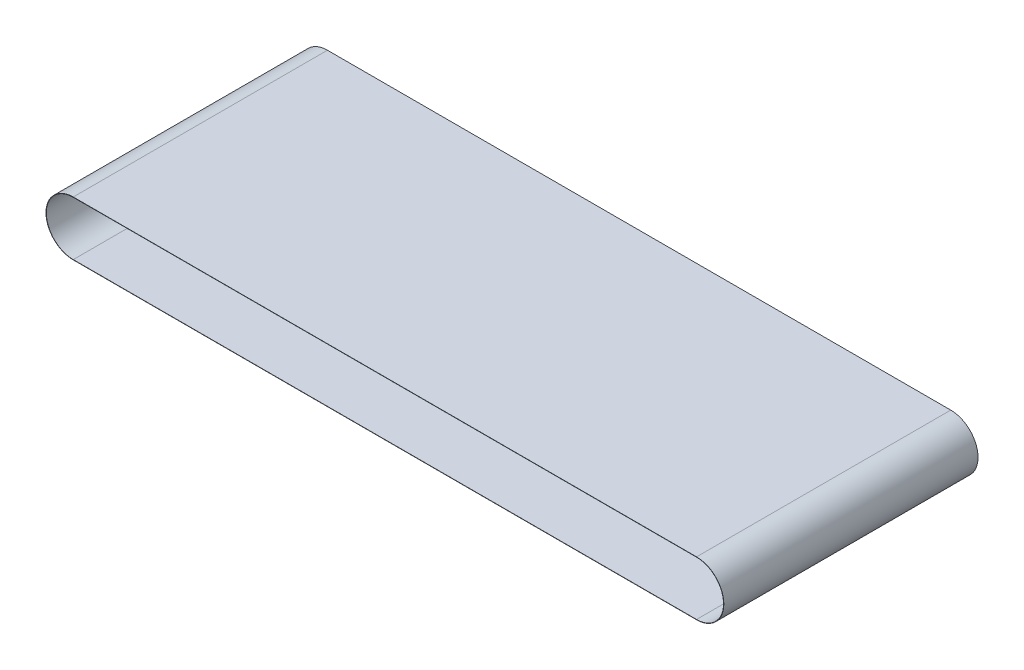
ISO-10303-21;
HEADER;
FILE_DESCRIPTION(('STEP AP214'),'2;1');
FILE_NAME('part.step','',(''),(''),'','','');
FILE_SCHEMA(('AUTOMOTIVE_DESIGN { 1 0 10303 214 1 1 1 1 }'));
ENDSEC;
DATA;
#1=APPLICATION_CONTEXT('core data for automotive mechanical design processes');
#2=APPLICATION_PROTOCOL_DEFINITION('international standard','automotive_design',2000,#1);
#3=PRODUCT_CONTEXT('',#1,'mechanical');
#4=PRODUCT('Part','Part','',(#3));
#5=PRODUCT_RELATED_PRODUCT_CATEGORY('part','',(#4));
#6=PRODUCT_DEFINITION_FORMATION('','',#4);
#7=PRODUCT_DEFINITION_CONTEXT('part definition',#1,'design');
#8=PRODUCT_DEFINITION('design','',#6,#7);
#9=PRODUCT_DEFINITION_SHAPE('','',#8);
#10=(LENGTH_UNIT() NAMED_UNIT(*) SI_UNIT(.MILLI.,.METRE.));
#11=(NAMED_UNIT(*) PLANE_ANGLE_UNIT() SI_UNIT($,.RADIAN.));
#12=(NAMED_UNIT(*) SI_UNIT($,.STERADIAN.) SOLID_ANGLE_UNIT());
#13=UNCERTAINTY_MEASURE_WITH_UNIT(LENGTH_MEASURE(1.E-05),#10,'distance_accuracy_value','');
#14=(GEOMETRIC_REPRESENTATION_CONTEXT(3) GLOBAL_UNCERTAINTY_ASSIGNED_CONTEXT((#13)) GLOBAL_UNIT_ASSIGNED_CONTEXT((#10,
#11,#12)) REPRESENTATION_CONTEXT('',''));
#15=CARTESIAN_POINT('',(0.,0.,0.));
#16=DIRECTION('',(0.,0.,1.));
#17=DIRECTION('',(1.,0.,0.));
#18=AXIS2_PLACEMENT_3D('',#15,#16,#17);
#19=CARTESIAN_POINT('',(0.,0.,-114.3));
#20=DIRECTION('',(0.,0.,1.));
#21=DIRECTION('',(1.,0.,0.));
#22=AXIS2_PLACEMENT_3D('',#19,#20,#21);
#23=CYLINDRICAL_SURFACE('',#22,24.511);
#24=CARTESIAN_POINT('',(0.,0.,114.3));
#25=DIRECTION('',(0.,0.,1.));
#26=DIRECTION('',(1.,0.,0.));
#27=AXIS2_PLACEMENT_3D('',#24,#25,#26);
#28=CIRCLE('',#27,24.511);
#29=CARTESIAN_POINT('',(0.,24.511,114.3));
#30=VERTEX_POINT('',#29);
#31=CARTESIAN_POINT('',(0.,-24.511,114.3));
#32=VERTEX_POINT('',#31);
#33=EDGE_CURVE('E148',#30,#32,#28,.T.);
#34=ORIENTED_EDGE('',*,*,#33,.F.);
#35=DIRECTION('',(0.,0.,1.));
#36=VECTOR('',#35,1.);
#37=CARTESIAN_POINT('',(0.,24.511,-114.3));
#38=LINE('',#37,#36);
#39=CARTESIAN_POINT('',(0.,24.511,-114.3));
#40=VERTEX_POINT('',#39);
#41=EDGE_CURVE('E11',#40,#30,#38,.T.);
#42=ORIENTED_EDGE('',*,*,#41,.F.);
#43=CARTESIAN_POINT('',(0.,0.,-114.3));
#44=DIRECTION('',(0.,0.,1.));
#45=DIRECTION('',(1.,0.,0.));
#46=AXIS2_PLACEMENT_3D('',#43,#44,#45);
#47=CIRCLE('',#46,24.511);
#48=CARTESIAN_POINT('',(0.,-24.511,-114.3));
#49=VERTEX_POINT('',#48);
#50=EDGE_CURVE('E154',#40,#49,#47,.T.);
#51=ORIENTED_EDGE('',*,*,#50,.T.);
#52=DIRECTION('',(0.,0.,1.));
#53=VECTOR('',#52,1.);
#54=CARTESIAN_POINT('',(0.,-24.511,-114.3));
#55=LINE('',#54,#53);
#56=EDGE_CURVE('E42',#49,#32,#55,.T.);
#57=ORIENTED_EDGE('',*,*,#56,.T.);
#58=EDGE_LOOP('',(#34,#42,#51,#57));
#59=FACE_BOUND('',#58,.T.);
#60=ADVANCED_FACE('F39',(#59),#23,.T.);
#61=CARTESIAN_POINT('',(0.,24.511,-114.3));
#62=DIRECTION('',(0.,1.,0.));
#63=DIRECTION('',(0.,0.,1.));
#64=AXIS2_PLACEMENT_3D('',#61,#62,#63);
#65=PLANE('',#64);
#66=DIRECTION('',(-1.,0.,0.));
#67=VECTOR('',#66,1.);
#68=CARTESIAN_POINT('',(0.,24.511,114.3));
#69=LINE('',#68,#67);
#70=CARTESIAN_POINT('',(560.578,24.511,114.3));
#71=VERTEX_POINT('',#70);
#72=EDGE_CURVE('E159',#71,#30,#69,.T.);
#73=ORIENTED_EDGE('',*,*,#72,.F.);
#74=DIRECTION('',(0.,0.,1.));
#75=VECTOR('',#74,1.);
#76=CARTESIAN_POINT('',(560.578,24.511,-114.3));
#77=LINE('',#76,#75);
#78=CARTESIAN_POINT('',(560.578,24.511,-114.3));
#79=VERTEX_POINT('',#78);
#80=EDGE_CURVE('E48',#79,#71,#77,.T.);
#81=ORIENTED_EDGE('',*,*,#80,.F.);
#82=DIRECTION('',(-1.,0.,0.));
#83=VECTOR('',#82,1.);
#84=CARTESIAN_POINT('',(0.,24.511,-114.3));
#85=LINE('',#84,#83);
#86=EDGE_CURVE('E167',#79,#40,#85,.T.);
#87=ORIENTED_EDGE('',*,*,#86,.T.);
#88=ORIENTED_EDGE('',*,*,#41,.T.);
#89=EDGE_LOOP('',(#73,#81,#87,#88));
#90=FACE_BOUND('',#89,.T.);
#91=ADVANCED_FACE('F201',(#90),#65,.T.);
#92=CARTESIAN_POINT('',(560.578,0.,-114.3));
#93=DIRECTION('',(0.,0.,1.));
#94=DIRECTION('',(1.,0.,0.));
#95=AXIS2_PLACEMENT_3D('',#92,#93,#94);
#96=CYLINDRICAL_SURFACE('',#95,24.511);
#97=CARTESIAN_POINT('',(560.578,0.,114.3));
#98=DIRECTION('',(0.,0.,1.));
#99=DIRECTION('',(1.,0.,0.));
#100=AXIS2_PLACEMENT_3D('',#97,#98,#99);
#101=CIRCLE('',#100,24.511);
#102=CARTESIAN_POINT('',(560.578,-24.511,114.3));
#103=VERTEX_POINT('',#102);
#104=EDGE_CURVE('E178',#103,#71,#101,.T.);
#105=ORIENTED_EDGE('',*,*,#104,.F.);
#106=DIRECTION('',(0.,0.,1.));
#107=VECTOR('',#106,1.);
#108=CARTESIAN_POINT('',(560.578,-24.511,-114.3));
#109=LINE('',#108,#107);
#110=CARTESIAN_POINT('',(560.578,-24.511,-114.3));
#111=VERTEX_POINT('',#110);
#112=EDGE_CURVE('E186',#111,#103,#109,.T.);
#113=ORIENTED_EDGE('',*,*,#112,.F.);
#114=CARTESIAN_POINT('',(560.578,0.,-114.3));
#115=DIRECTION('',(0.,0.,1.));
#116=DIRECTION('',(1.,0.,0.));
#117=AXIS2_PLACEMENT_3D('',#114,#115,#116);
#118=CIRCLE('',#117,24.511);
#119=EDGE_CURVE('E163',#111,#79,#118,.T.);
#120=ORIENTED_EDGE('',*,*,#119,.T.);
#121=ORIENTED_EDGE('',*,*,#80,.T.);
#122=EDGE_LOOP('',(#105,#113,#120,#121));
#123=FACE_BOUND('',#122,.T.);
#124=ADVANCED_FACE('F205',(#123),#96,.T.);
#125=CARTESIAN_POINT('',(0.,-24.511,-114.3));
#126=DIRECTION('',(0.,-1.,0.));
#127=DIRECTION('',(0.,0.,-1.));
#128=AXIS2_PLACEMENT_3D('',#125,#126,#127);
#129=PLANE('',#128);
#130=DIRECTION('',(1.,0.,0.));
#131=VECTOR('',#130,1.);
#132=CARTESIAN_POINT('',(0.,-24.511,114.3));
#133=LINE('',#132,#131);
#134=EDGE_CURVE('E174',#32,#103,#133,.T.);
#135=ORIENTED_EDGE('',*,*,#134,.F.);
#136=ORIENTED_EDGE('',*,*,#56,.F.);
#137=DIRECTION('',(1.,0.,0.));
#138=VECTOR('',#137,1.);
#139=CARTESIAN_POINT('',(0.,-24.511,-114.3));
#140=LINE('',#139,#138);
#141=EDGE_CURVE('E158',#49,#111,#140,.T.);
#142=ORIENTED_EDGE('',*,*,#141,.T.);
#143=ORIENTED_EDGE('',*,*,#112,.T.);
#144=EDGE_LOOP('',(#135,#136,#142,#143));
#145=FACE_BOUND('',#144,.T.);
#146=ADVANCED_FACE('F196',(#145),#129,.T.);
#147=CARTESIAN_POINT('',(0.,0.,-114.3));
#148=DIRECTION('',(0.,0.,1.));
#149=DIRECTION('',(1.,0.,0.));
#150=AXIS2_PLACEMENT_3D('',#147,#148,#149);
#151=PLANE('',#150);
#152=DIRECTION('',(-1.,0.,0.));
#153=VECTOR('',#152,1.);
#154=CARTESIAN_POINT('',(0.,24.257,-114.3));
#155=LINE('',#154,#153);
#156=CARTESIAN_POINT('',(560.578,24.257,-114.3));
#157=VERTEX_POINT('',#156);
#158=CARTESIAN_POINT('',(0.,24.257,-114.3));
#159=VERTEX_POINT('',#158);
#160=EDGE_CURVE('E114',#157,#159,#155,.T.);
#161=ORIENTED_EDGE('',*,*,#160,.T.);
#162=CARTESIAN_POINT('',(0.,0.,-114.3));
#163=DIRECTION('',(0.,0.,1.));
#164=DIRECTION('',(1.,0.,0.));
#165=AXIS2_PLACEMENT_3D('',#162,#163,#164);
#166=CIRCLE('',#165,24.257);
#167=CARTESIAN_POINT('',(0.,-24.257,-114.3));
#168=VERTEX_POINT('',#167);
#169=EDGE_CURVE('E107',#159,#168,#166,.T.);
#170=ORIENTED_EDGE('',*,*,#169,.T.);
#171=DIRECTION('',(1.,0.,0.));
#172=VECTOR('',#171,1.);
#173=CARTESIAN_POINT('',(0.,-24.257,-114.3));
#174=LINE('',#173,#172);
#175=CARTESIAN_POINT('',(560.578,-24.257,-114.3));
#176=VERTEX_POINT('',#175);
#177=EDGE_CURVE('E117',#168,#176,#174,.T.);
#178=ORIENTED_EDGE('',*,*,#177,.T.);
#179=CARTESIAN_POINT('',(560.578,0.,-114.3));
#180=DIRECTION('',(0.,0.,1.));
#181=DIRECTION('',(1.,0.,0.));
#182=AXIS2_PLACEMENT_3D('',#179,#180,#181);
#183=CIRCLE('',#182,24.257);
#184=EDGE_CURVE('E56',#176,#157,#183,.T.);
#185=ORIENTED_EDGE('',*,*,#184,.T.);
#186=EDGE_LOOP('',(#161,#170,#178,#185));
#187=FACE_BOUND('',#186,.T.);
#188=ORIENTED_EDGE('',*,*,#50,.F.);
#189=ORIENTED_EDGE('',*,*,#86,.F.);
#190=ORIENTED_EDGE('',*,*,#119,.F.);
#191=ORIENTED_EDGE('',*,*,#141,.F.);
#192=EDGE_LOOP('',(#188,#189,#190,#191));
#193=FACE_BOUND('',#192,.T.);
#194=ADVANCED_FACE('F122',(#187,#193),#151,.F.);
#195=CARTESIAN_POINT('',(0.,0.,114.3));
#196=DIRECTION('',(0.,0.,1.));
#197=DIRECTION('',(1.,0.,0.));
#198=AXIS2_PLACEMENT_3D('',#195,#196,#197);
#199=PLANE('',#198);
#200=CARTESIAN_POINT('',(0.,0.,114.3));
#201=DIRECTION('',(0.,0.,1.));
#202=DIRECTION('',(1.,0.,0.));
#203=AXIS2_PLACEMENT_3D('',#200,#201,#202);
#204=CIRCLE('',#203,24.257);
#205=CARTESIAN_POINT('',(0.,24.257,114.3));
#206=VERTEX_POINT('',#205);
#207=CARTESIAN_POINT('',(0.,-24.257,114.3));
#208=VERTEX_POINT('',#207);
#209=EDGE_CURVE('E64',#206,#208,#204,.T.);
#210=ORIENTED_EDGE('',*,*,#209,.F.);
#211=DIRECTION('',(-1.,0.,0.));
#212=VECTOR('',#211,1.);
#213=CARTESIAN_POINT('',(0.,24.257,114.3));
#214=LINE('',#213,#212);
#215=CARTESIAN_POINT('',(560.578,24.257,114.3));
#216=VERTEX_POINT('',#215);
#217=EDGE_CURVE('E126',#216,#206,#214,.T.);
#218=ORIENTED_EDGE('',*,*,#217,.F.);
#219=CARTESIAN_POINT('',(560.578,0.,114.3));
#220=DIRECTION('',(0.,0.,1.));
#221=DIRECTION('',(1.,0.,0.));
#222=AXIS2_PLACEMENT_3D('',#219,#220,#221);
#223=CIRCLE('',#222,24.257);
#224=CARTESIAN_POINT('',(560.578,-24.257,114.3));
#225=VERTEX_POINT('',#224);
#226=EDGE_CURVE('E130',#225,#216,#223,.T.);
#227=ORIENTED_EDGE('',*,*,#226,.F.);
#228=DIRECTION('',(1.,0.,0.));
#229=VECTOR('',#228,1.);
#230=CARTESIAN_POINT('',(0.,-24.257,114.3));
#231=LINE('',#230,#229);
#232=EDGE_CURVE('E139',#208,#225,#231,.T.);
#233=ORIENTED_EDGE('',*,*,#232,.F.);
#234=EDGE_LOOP('',(#210,#218,#227,#233));
#235=FACE_BOUND('',#234,.T.);
#236=ORIENTED_EDGE('',*,*,#33,.T.);
#237=ORIENTED_EDGE('',*,*,#134,.T.);
#238=ORIENTED_EDGE('',*,*,#104,.T.);
#239=ORIENTED_EDGE('',*,*,#72,.T.);
#240=EDGE_LOOP('',(#236,#237,#238,#239));
#241=FACE_BOUND('',#240,.T.);
#242=ADVANCED_FACE('F198',(#235,#241),#199,.T.);
#243=CARTESIAN_POINT('',(0.,0.,-114.3));
#244=DIRECTION('',(0.,0.,1.));
#245=DIRECTION('',(1.,0.,0.));
#246=AXIS2_PLACEMENT_3D('',#243,#244,#245);
#247=CYLINDRICAL_SURFACE('',#246,24.257);
#248=ORIENTED_EDGE('',*,*,#209,.T.);
#249=DIRECTION('',(0.,0.,1.));
#250=VECTOR('',#249,1.);
#251=CARTESIAN_POINT('',(0.,-24.257,-114.3));
#252=LINE('',#251,#250);
#253=EDGE_CURVE('E103',#168,#208,#252,.T.);
#254=ORIENTED_EDGE('',*,*,#253,.F.);
#255=ORIENTED_EDGE('',*,*,#169,.F.);
#256=DIRECTION('',(0.,0.,1.));
#257=VECTOR('',#256,1.);
#258=CARTESIAN_POINT('',(0.,24.257,-114.3));
#259=LINE('',#258,#257);
#260=EDGE_CURVE('E145',#159,#206,#259,.T.);
#261=ORIENTED_EDGE('',*,*,#260,.T.);
#262=EDGE_LOOP('',(#248,#254,#255,#261));
#263=FACE_BOUND('',#262,.T.);
#264=ADVANCED_FACE('F105',(#263),#247,.F.);
#265=CARTESIAN_POINT('',(0.,24.257,-114.3));
#266=DIRECTION('',(0.,1.,0.));
#267=DIRECTION('',(0.,0.,1.));
#268=AXIS2_PLACEMENT_3D('',#265,#266,#267);
#269=PLANE('',#268);
#270=ORIENTED_EDGE('',*,*,#217,.T.);
#271=ORIENTED_EDGE('',*,*,#260,.F.);
#272=ORIENTED_EDGE('',*,*,#160,.F.);
#273=DIRECTION('',(0.,0.,1.));
#274=VECTOR('',#273,1.);
#275=CARTESIAN_POINT('',(560.578,24.257,-114.3));
#276=LINE('',#275,#274);
#277=EDGE_CURVE('E149',#157,#216,#276,.T.);
#278=ORIENTED_EDGE('',*,*,#277,.T.);
#279=EDGE_LOOP('',(#270,#271,#272,#278));
#280=FACE_BOUND('',#279,.T.);
#281=ADVANCED_FACE('F256',(#280),#269,.F.);
#282=CARTESIAN_POINT('',(560.578,0.,-114.3));
#283=DIRECTION('',(0.,0.,1.));
#284=DIRECTION('',(1.,0.,0.));
#285=AXIS2_PLACEMENT_3D('',#282,#283,#284);
#286=CYLINDRICAL_SURFACE('',#285,24.257);
#287=ORIENTED_EDGE('',*,*,#226,.T.);
#288=ORIENTED_EDGE('',*,*,#277,.F.);
#289=ORIENTED_EDGE('',*,*,#184,.F.);
#290=DIRECTION('',(0.,0.,1.));
#291=VECTOR('',#290,1.);
#292=CARTESIAN_POINT('',(560.578,-24.257,-114.3));
#293=LINE('',#292,#291);
#294=EDGE_CURVE('E113',#176,#225,#293,.T.);
#295=ORIENTED_EDGE('',*,*,#294,.T.);
#296=EDGE_LOOP('',(#287,#288,#289,#295));
#297=FACE_BOUND('',#296,.T.);
#298=ADVANCED_FACE('F265',(#297),#286,.F.);
#299=CARTESIAN_POINT('',(0.,-24.257,-114.3));
#300=DIRECTION('',(0.,-1.,0.));
#301=DIRECTION('',(0.,0.,-1.));
#302=AXIS2_PLACEMENT_3D('',#299,#300,#301);
#303=PLANE('',#302);
#304=ORIENTED_EDGE('',*,*,#232,.T.);
#305=ORIENTED_EDGE('',*,*,#294,.F.);
#306=ORIENTED_EDGE('',*,*,#177,.F.);
#307=ORIENTED_EDGE('',*,*,#253,.T.);
#308=EDGE_LOOP('',(#304,#305,#306,#307));
#309=FACE_BOUND('',#308,.T.);
#310=ADVANCED_FACE('F118',(#309),#303,.F.);
#311=CLOSED_SHELL('',(#60,#91,#124,#146,#194,#242,#264,#281,#298,#310));
#312=MANIFOLD_SOLID_BREP('B2',#311);
#313=ADVANCED_BREP_SHAPE_REPRESENTATION('',(#18,#312),#14);
#314=SHAPE_DEFINITION_REPRESENTATION(#9,#313);
ENDSEC;
END-ISO-10303-21;
